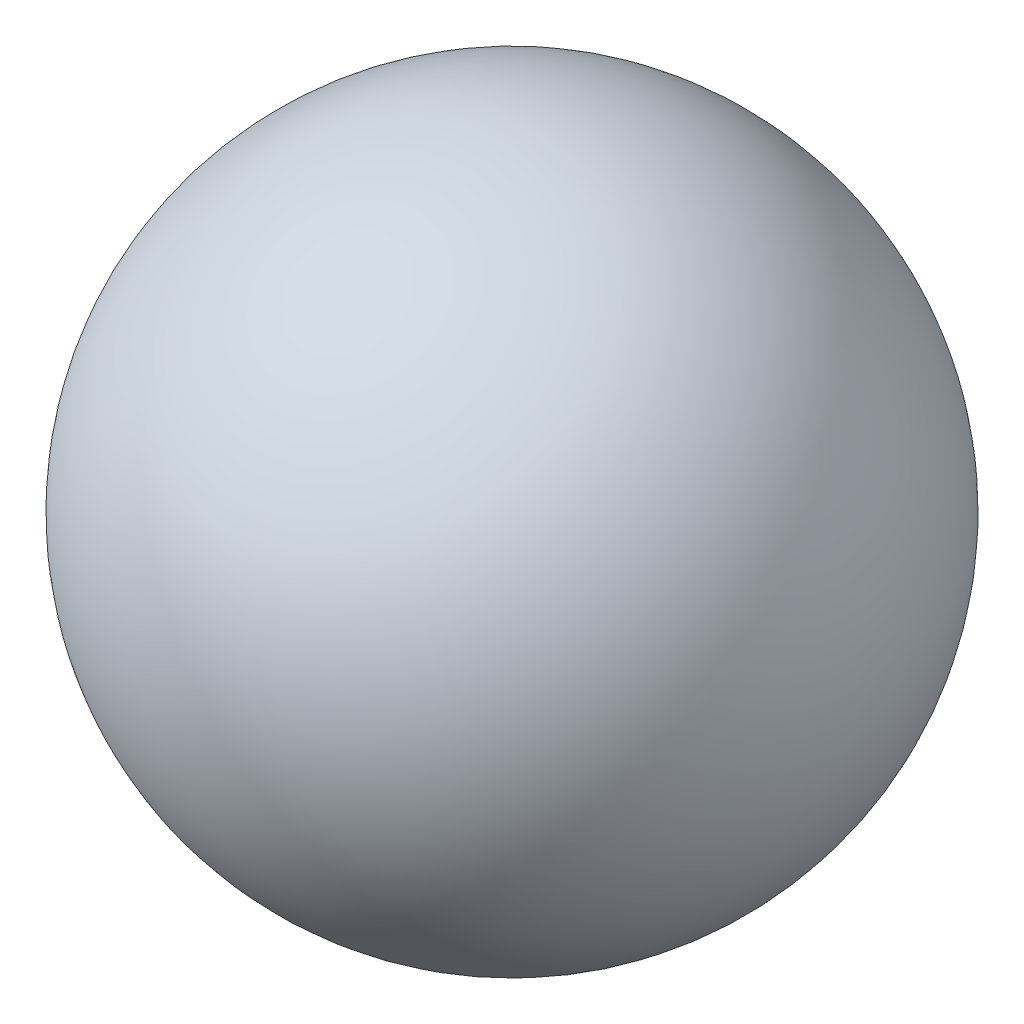
ISO-10303-21;
HEADER;
FILE_DESCRIPTION(('STEP AP214'),'2;1');
FILE_NAME('part.step','',(''),(''),'','','');
FILE_SCHEMA(('AUTOMOTIVE_DESIGN { 1 0 10303 214 1 1 1 1 }'));
ENDSEC;
DATA;
#1=APPLICATION_CONTEXT('core data for automotive mechanical design processes');
#2=APPLICATION_PROTOCOL_DEFINITION('international standard','automotive_design',2000,#1);
#3=PRODUCT_CONTEXT('',#1,'mechanical');
#4=PRODUCT('Part','Part','',(#3));
#5=PRODUCT_RELATED_PRODUCT_CATEGORY('part','',(#4));
#6=PRODUCT_DEFINITION_FORMATION('','',#4);
#7=PRODUCT_DEFINITION_CONTEXT('part definition',#1,'design');
#8=PRODUCT_DEFINITION('design','',#6,#7);
#9=PRODUCT_DEFINITION_SHAPE('','',#8);
#10=(LENGTH_UNIT() NAMED_UNIT(*) SI_UNIT(.MILLI.,.METRE.));
#11=(NAMED_UNIT(*) PLANE_ANGLE_UNIT() SI_UNIT($,.RADIAN.));
#12=(NAMED_UNIT(*) SI_UNIT($,.STERADIAN.) SOLID_ANGLE_UNIT());
#13=UNCERTAINTY_MEASURE_WITH_UNIT(LENGTH_MEASURE(1.E-05),#10,'distance_accuracy_value','');
#14=(GEOMETRIC_REPRESENTATION_CONTEXT(3) GLOBAL_UNCERTAINTY_ASSIGNED_CONTEXT((#13)) GLOBAL_UNIT_ASSIGNED_CONTEXT((#10,
#11,#12)) REPRESENTATION_CONTEXT('',''));
#15=CARTESIAN_POINT('',(0.,0.,0.));
#16=DIRECTION('',(0.,0.,1.));
#17=DIRECTION('',(1.,0.,0.));
#18=AXIS2_PLACEMENT_3D('',#15,#16,#17);
#19=CARTESIAN_POINT('',(-5.38416163029707,-2.,-10.4438165216954));
#20=DIRECTION('',(0.,0.,1.));
#21=DIRECTION('',(1.,0.,0.));
#22=AXIS2_PLACEMENT_3D('',#19,#20,#21);
#23=SPHERICAL_SURFACE('',#22,1.05);
#24=CARTESIAN_POINT('',(-5.38416163029707,-2.,-9.3938165216954));
#25=VERTEX_POINT('',#24);
#26=VERTEX_LOOP('',#25);
#27=FACE_BOUND('',#26,.T.);
#28=ADVANCED_FACE('F13',(#27),#23,.T.);
#29=CLOSED_SHELL('',(#28));
#30=MANIFOLD_SOLID_BREP('B1',#29);
#31=ADVANCED_BREP_SHAPE_REPRESENTATION('',(#18,#30),#14);
#32=SHAPE_DEFINITION_REPRESENTATION(#9,#31);
ENDSEC;
END-ISO-10303-21;
